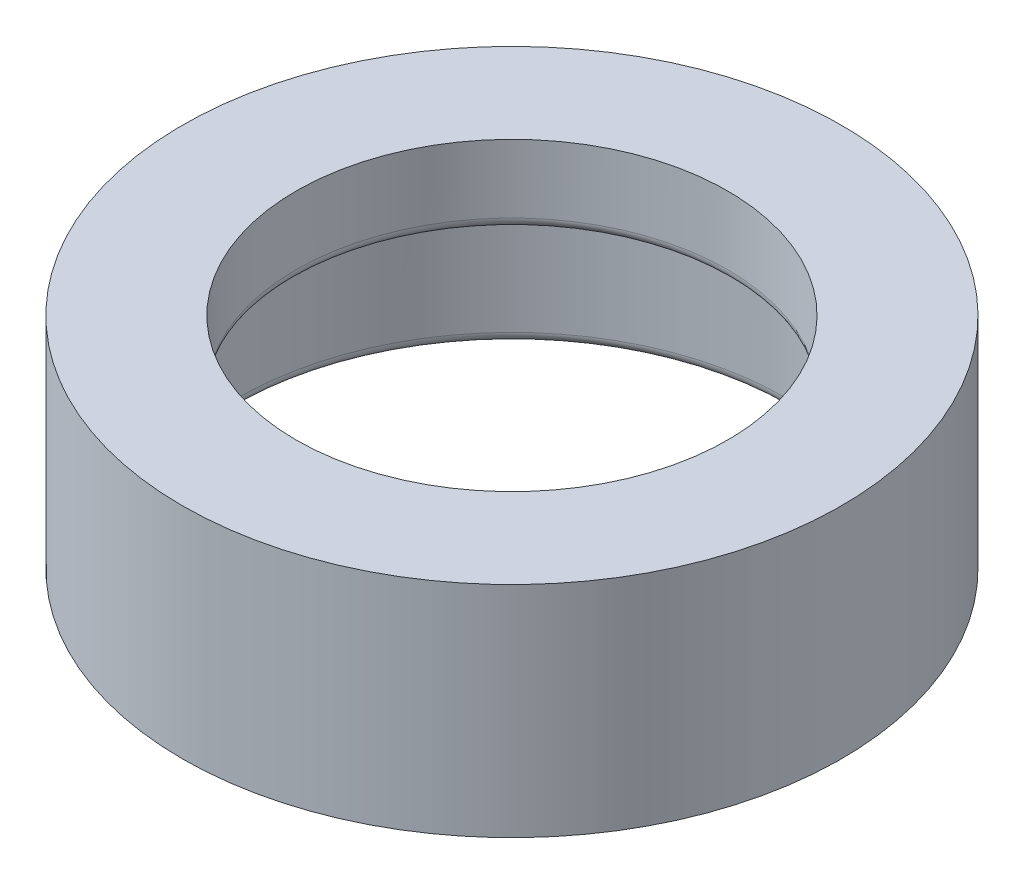
ISO-10303-21;
HEADER;
FILE_DESCRIPTION(('STEP AP214'),'2;1');
FILE_NAME('part.step','',(''),(''),'','','');
FILE_SCHEMA(('AUTOMOTIVE_DESIGN { 1 0 10303 214 1 1 1 1 }'));
ENDSEC;
DATA;
#1=APPLICATION_CONTEXT('core data for automotive mechanical design processes');
#2=APPLICATION_PROTOCOL_DEFINITION('international standard','automotive_design',2000,#1);
#3=PRODUCT_CONTEXT('',#1,'mechanical');
#4=PRODUCT('Part','Part','',(#3));
#5=PRODUCT_RELATED_PRODUCT_CATEGORY('part','',(#4));
#6=PRODUCT_DEFINITION_FORMATION('','',#4);
#7=PRODUCT_DEFINITION_CONTEXT('part definition',#1,'design');
#8=PRODUCT_DEFINITION('design','',#6,#7);
#9=PRODUCT_DEFINITION_SHAPE('','',#8);
#10=(LENGTH_UNIT() NAMED_UNIT(*) SI_UNIT(.MILLI.,.METRE.));
#11=(NAMED_UNIT(*) PLANE_ANGLE_UNIT() SI_UNIT($,.RADIAN.));
#12=(NAMED_UNIT(*) SI_UNIT($,.STERADIAN.) SOLID_ANGLE_UNIT());
#13=UNCERTAINTY_MEASURE_WITH_UNIT(LENGTH_MEASURE(1.E-05),#10,'distance_accuracy_value','');
#14=(GEOMETRIC_REPRESENTATION_CONTEXT(3) GLOBAL_UNCERTAINTY_ASSIGNED_CONTEXT((#13)) GLOBAL_UNIT_ASSIGNED_CONTEXT((#10,
#11,#12)) REPRESENTATION_CONTEXT('',''));
#15=CARTESIAN_POINT('',(0.,0.,0.));
#16=DIRECTION('',(0.,0.,1.));
#17=DIRECTION('',(1.,0.,0.));
#18=AXIS2_PLACEMENT_3D('',#15,#16,#17);
#19=CARTESIAN_POINT('',(0.,20.32,0.));
#20=DIRECTION('',(0.,-1.,0.));
#21=DIRECTION('',(0.,0.,-1.));
#22=AXIS2_PLACEMENT_3D('',#19,#20,#21);
#23=CYLINDRICAL_SURFACE('',#22,30.55);
#24=CARTESIAN_POINT('',(0.,20.32,0.));
#25=DIRECTION('',(0.,1.,0.));
#26=DIRECTION('',(0.,0.,1.));
#27=AXIS2_PLACEMENT_3D('',#24,#25,#26);
#28=CIRCLE('',#27,30.55);
#29=CARTESIAN_POINT('',(0.,20.32,30.55));
#30=VERTEX_POINT('',#29);
#31=EDGE_CURVE('E54',#30,#30,#28,.T.);
#32=ORIENTED_EDGE('',*,*,#31,.F.);
#33=EDGE_LOOP('',(#32));
#34=FACE_BOUND('',#33,.T.);
#35=CARTESIAN_POINT('',(0.,0.,0.));
#36=DIRECTION('',(0.,1.,0.));
#37=DIRECTION('',(0.,0.,1.));
#38=AXIS2_PLACEMENT_3D('',#35,#36,#37);
#39=CIRCLE('',#38,30.55);
#40=CARTESIAN_POINT('',(0.,0.,30.55));
#41=VERTEX_POINT('',#40);
#42=EDGE_CURVE('E55',#41,#41,#39,.T.);
#43=ORIENTED_EDGE('',*,*,#42,.T.);
#44=EDGE_LOOP('',(#43));
#45=FACE_BOUND('',#44,.T.);
#46=ADVANCED_FACE('F34',(#34,#45),#23,.T.);
#47=CARTESIAN_POINT('',(0.,20.32,0.));
#48=DIRECTION('',(0.,1.,0.));
#49=DIRECTION('',(0.,0.,1.));
#50=AXIS2_PLACEMENT_3D('',#47,#48,#49);
#51=PLANE('',#50);
#52=CARTESIAN_POINT('',(0.,20.32,0.));
#53=DIRECTION('',(0.,1.,0.));
#54=DIRECTION('',(0.,0.,1.));
#55=AXIS2_PLACEMENT_3D('',#52,#53,#54);
#56=CIRCLE('',#55,20.);
#57=CARTESIAN_POINT('',(0.,20.32,20.));
#58=VERTEX_POINT('',#57);
#59=EDGE_CURVE('E63',#58,#58,#56,.T.);
#60=ORIENTED_EDGE('',*,*,#59,.F.);
#61=EDGE_LOOP('',(#60));
#62=FACE_BOUND('',#61,.T.);
#63=ORIENTED_EDGE('',*,*,#31,.T.);
#64=EDGE_LOOP('',(#63));
#65=FACE_BOUND('',#64,.T.);
#66=ADVANCED_FACE('F69',(#62,#65),#51,.T.);
#67=CARTESIAN_POINT('',(0.,0.,0.));
#68=DIRECTION('',(0.,1.,0.));
#69=DIRECTION('',(0.,0.,1.));
#70=AXIS2_PLACEMENT_3D('',#67,#68,#69);
#71=PLANE('',#70);
#72=CARTESIAN_POINT('',(0.,0.,0.));
#73=DIRECTION('',(0.,1.,0.));
#74=DIRECTION('',(0.,0.,1.));
#75=AXIS2_PLACEMENT_3D('',#72,#73,#74);
#76=CIRCLE('',#75,26.404);
#77=CARTESIAN_POINT('',(0.,0.,26.404));
#78=VERTEX_POINT('',#77);
#79=EDGE_CURVE('E45',#78,#78,#76,.T.);
#80=ORIENTED_EDGE('',*,*,#79,.T.);
#81=EDGE_LOOP('',(#80));
#82=FACE_BOUND('',#81,.T.);
#83=ORIENTED_EDGE('',*,*,#42,.F.);
#84=EDGE_LOOP('',(#83));
#85=FACE_BOUND('',#84,.T.);
#86=ADVANCED_FACE('F72',(#82,#85),#71,.F.);
#87=CARTESIAN_POINT('',(0.,13.,0.));
#88=DIRECTION('',(0.,-1.,0.));
#89=DIRECTION('',(0.,0.,-1.));
#90=AXIS2_PLACEMENT_3D('',#87,#88,#89);
#91=CYLINDRICAL_SURFACE('',#90,25.404);
#92=CARTESIAN_POINT('',(0.,0.999999999999999,0.));
#93=DIRECTION('',(0.,1.,0.));
#94=DIRECTION('',(0.,0.,1.));
#95=AXIS2_PLACEMENT_3D('',#92,#93,#94);
#96=CIRCLE('',#95,25.404);
#97=CARTESIAN_POINT('',(0.,0.999999999999999,25.404));
#98=VERTEX_POINT('',#97);
#99=EDGE_CURVE('E49',#98,#98,#96,.F.);
#100=ORIENTED_EDGE('',*,*,#99,.T.);
#101=EDGE_LOOP('',(#100));
#102=FACE_BOUND('',#101,.T.);
#103=CARTESIAN_POINT('',(0.,13.,0.));
#104=DIRECTION('',(0.,-1.,0.));
#105=DIRECTION('',(0.,0.,-1.));
#106=AXIS2_PLACEMENT_3D('',#103,#104,#105);
#107=CIRCLE('',#106,25.404);
#108=CARTESIAN_POINT('',(0.,13.,-25.404));
#109=VERTEX_POINT('',#108);
#110=EDGE_CURVE('E58',#109,#109,#107,.T.);
#111=ORIENTED_EDGE('',*,*,#110,.F.);
#112=EDGE_LOOP('',(#111));
#113=FACE_BOUND('',#112,.T.);
#114=ADVANCED_FACE('F82',(#102,#113),#91,.F.);
#115=CARTESIAN_POINT('',(0.,13.,0.));
#116=DIRECTION('',(0.,-1.,0.));
#117=DIRECTION('',(0.,0.,-1.));
#118=AXIS2_PLACEMENT_3D('',#115,#116,#117);
#119=PLANE('',#118);
#120=CARTESIAN_POINT('',(0.,13.,0.));
#121=DIRECTION('',(0.,-1.,0.));
#122=DIRECTION('',(0.,0.,-1.));
#123=AXIS2_PLACEMENT_3D('',#120,#121,#122);
#124=CIRCLE('',#123,21.);
#125=CARTESIAN_POINT('',(0.,13.,-21.));
#126=VERTEX_POINT('',#125);
#127=EDGE_CURVE('E10',#126,#126,#124,.F.);
#128=ORIENTED_EDGE('',*,*,#127,.T.);
#129=EDGE_LOOP('',(#128));
#130=FACE_BOUND('',#129,.T.);
#131=ORIENTED_EDGE('',*,*,#110,.T.);
#132=EDGE_LOOP('',(#131));
#133=FACE_BOUND('',#132,.T.);
#134=ADVANCED_FACE('F88',(#130,#133),#119,.T.);
#135=CARTESIAN_POINT('',(0.,0.,0.));
#136=DIRECTION('',(0.,1.,0.));
#137=DIRECTION('',(0.,0.,1.));
#138=AXIS2_PLACEMENT_3D('',#135,#136,#137);
#139=CYLINDRICAL_SURFACE('',#138,20.);
#140=CARTESIAN_POINT('',(0.,14.,0.));
#141=DIRECTION('',(0.,-1.,0.));
#142=DIRECTION('',(0.,0.,-1.));
#143=AXIS2_PLACEMENT_3D('',#140,#141,#142);
#144=CIRCLE('',#143,20.);
#145=CARTESIAN_POINT('',(0.,14.,-20.));
#146=VERTEX_POINT('',#145);
#147=EDGE_CURVE('E41',#146,#146,#144,.T.);
#148=ORIENTED_EDGE('',*,*,#147,.T.);
#149=EDGE_LOOP('',(#148));
#150=FACE_BOUND('',#149,.T.);
#151=ORIENTED_EDGE('',*,*,#59,.T.);
#152=EDGE_LOOP('',(#151));
#153=FACE_BOUND('',#152,.T.);
#154=ADVANCED_FACE('F67',(#150,#153),#139,.F.);
#155=CARTESIAN_POINT('',(0.,0.999999999999999,0.));
#156=DIRECTION('',(0.,1.,0.));
#157=DIRECTION('',(0.,0.,1.));
#158=AXIS2_PLACEMENT_3D('',#155,#156,#157);
#159=TOROIDAL_SURFACE('',#158,26.404,1.);
#160=ORIENTED_EDGE('',*,*,#79,.F.);
#161=EDGE_LOOP('',(#160));
#162=FACE_BOUND('',#161,.T.);
#163=ORIENTED_EDGE('',*,*,#99,.F.);
#164=EDGE_LOOP('',(#163));
#165=FACE_BOUND('',#164,.T.);
#166=ADVANCED_FACE('F91',(#162,#165),#159,.T.);
#167=CARTESIAN_POINT('',(0.,14.,0.));
#168=DIRECTION('',(0.,-1.,0.));
#169=DIRECTION('',(0.,0.,-1.));
#170=AXIS2_PLACEMENT_3D('',#167,#168,#169);
#171=TOROIDAL_SURFACE('',#170,21.,1.);
#172=ORIENTED_EDGE('',*,*,#127,.F.);
#173=EDGE_LOOP('',(#172));
#174=FACE_BOUND('',#173,.T.);
#175=ORIENTED_EDGE('',*,*,#147,.F.);
#176=EDGE_LOOP('',(#175));
#177=FACE_BOUND('',#176,.T.);
#178=ADVANCED_FACE('F36',(#174,#177),#171,.T.);
#179=CLOSED_SHELL('',(#46,#66,#86,#114,#134,#154,#166,#178));
#180=MANIFOLD_SOLID_BREP('B2',#179);
#181=ADVANCED_BREP_SHAPE_REPRESENTATION('',(#18,#180),#14);
#182=SHAPE_DEFINITION_REPRESENTATION(#9,#181);
ENDSEC;
END-ISO-10303-21;
